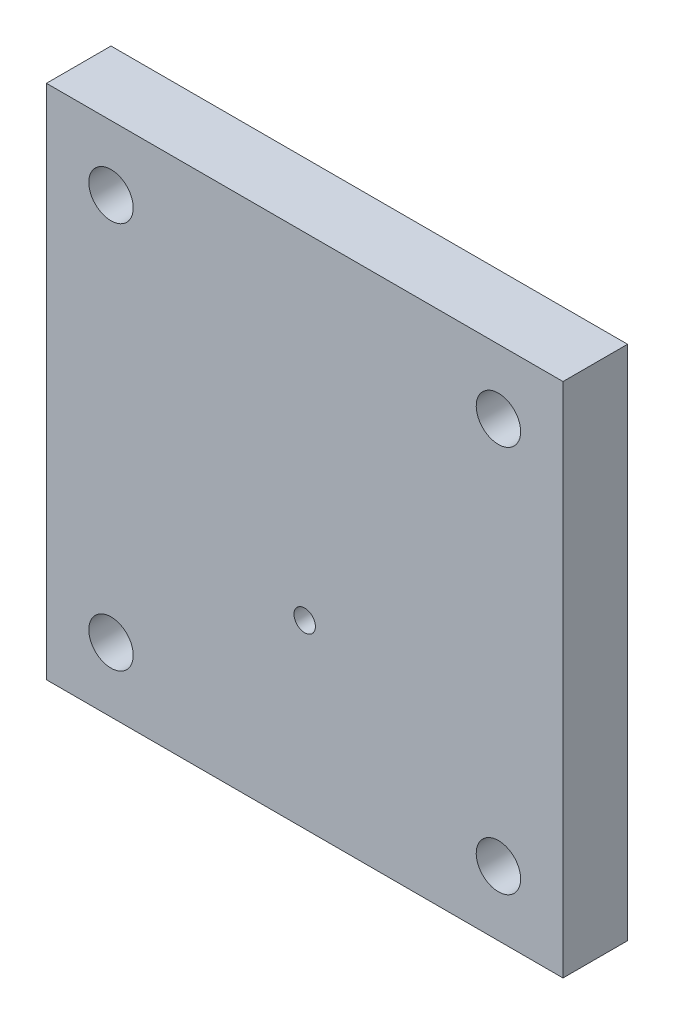
ISO-10303-21;
HEADER;
FILE_DESCRIPTION(('STEP AP214'),'2;1');
FILE_NAME('part.step','',(''),(''),'','','');
FILE_SCHEMA(('AUTOMOTIVE_DESIGN { 1 0 10303 214 1 1 1 1 }'));
ENDSEC;
DATA;
#1=APPLICATION_CONTEXT('core data for automotive mechanical design processes');
#2=APPLICATION_PROTOCOL_DEFINITION('international standard','automotive_design',2000,#1);
#3=PRODUCT_CONTEXT('',#1,'mechanical');
#4=PRODUCT('Part','Part','',(#3));
#5=PRODUCT_RELATED_PRODUCT_CATEGORY('part','',(#4));
#6=PRODUCT_DEFINITION_FORMATION('','',#4);
#7=PRODUCT_DEFINITION_CONTEXT('part definition',#1,'design');
#8=PRODUCT_DEFINITION('design','',#6,#7);
#9=PRODUCT_DEFINITION_SHAPE('','',#8);
#10=(LENGTH_UNIT() NAMED_UNIT(*) SI_UNIT(.MILLI.,.METRE.));
#11=(NAMED_UNIT(*) PLANE_ANGLE_UNIT() SI_UNIT($,.RADIAN.));
#12=(NAMED_UNIT(*) SI_UNIT($,.STERADIAN.) SOLID_ANGLE_UNIT());
#13=UNCERTAINTY_MEASURE_WITH_UNIT(LENGTH_MEASURE(1.E-05),#10,'distance_accuracy_value','');
#14=(GEOMETRIC_REPRESENTATION_CONTEXT(3) GLOBAL_UNCERTAINTY_ASSIGNED_CONTEXT((#13)) GLOBAL_UNIT_ASSIGNED_CONTEXT((#10,
#11,#12)) REPRESENTATION_CONTEXT('',''));
#15=CARTESIAN_POINT('',(0.,0.,0.));
#16=DIRECTION('',(0.,0.,1.));
#17=DIRECTION('',(1.,0.,0.));
#18=AXIS2_PLACEMENT_3D('',#15,#16,#17);
#19=CARTESIAN_POINT('',(-50.8,50.8,49.2));
#20=DIRECTION('',(1.,0.,0.));
#21=DIRECTION('',(0.,1.,0.));
#22=AXIS2_PLACEMENT_3D('',#19,#20,#21);
#23=PLANE('',#22);
#24=DIRECTION('',(0.,1.,0.));
#25=VECTOR('',#24,1.);
#26=CARTESIAN_POINT('',(-50.8,50.8,36.5000691489381));
#27=LINE('',#26,#25);
#28=CARTESIAN_POINT('',(-50.8,-50.8,36.5000691489379));
#29=VERTEX_POINT('',#28);
#30=CARTESIAN_POINT('',(-50.8,50.8,36.500069148938));
#31=VERTEX_POINT('',#30);
#32=EDGE_CURVE('E170',#29,#31,#27,.T.);
#33=ORIENTED_EDGE('',*,*,#32,.F.);
#34=DIRECTION('',(0.,0.,-1.));
#35=VECTOR('',#34,1.);
#36=CARTESIAN_POINT('',(-50.8,-50.8,49.2));
#37=LINE('',#36,#35);
#38=CARTESIAN_POINT('',(-50.8,-50.8,49.2));
#39=VERTEX_POINT('',#38);
#40=EDGE_CURVE('E184',#39,#29,#37,.T.);
#41=ORIENTED_EDGE('',*,*,#40,.F.);
#42=DIRECTION('',(0.,-1.,0.));
#43=VECTOR('',#42,1.);
#44=CARTESIAN_POINT('',(-50.8,50.8,49.2));
#45=LINE('',#44,#43);
#46=CARTESIAN_POINT('',(-50.8,50.8,49.2));
#47=VERTEX_POINT('',#46);
#48=EDGE_CURVE('E268',#47,#39,#45,.T.);
#49=ORIENTED_EDGE('',*,*,#48,.F.);
#50=DIRECTION('',(0.,0.,-1.));
#51=VECTOR('',#50,1.);
#52=CARTESIAN_POINT('',(-50.8,50.8,49.2));
#53=LINE('',#52,#51);
#54=EDGE_CURVE('E186',#47,#31,#53,.T.);
#55=ORIENTED_EDGE('',*,*,#54,.T.);
#56=EDGE_LOOP('',(#33,#41,#49,#55));
#57=FACE_BOUND('',#56,.T.);
#58=ADVANCED_FACE('F54',(#57),#23,.F.);
#59=CARTESIAN_POINT('',(-50.8,-50.8,49.2));
#60=DIRECTION('',(0.,1.,0.));
#61=DIRECTION('',(-1.,0.,0.));
#62=AXIS2_PLACEMENT_3D('',#59,#60,#61);
#63=PLANE('',#62);
#64=DIRECTION('',(-1.,0.,0.));
#65=VECTOR('',#64,1.);
#66=CARTESIAN_POINT('',(-50.8,-50.8,36.5000691489379));
#67=LINE('',#66,#65);
#68=CARTESIAN_POINT('',(50.8,-50.7999999999999,36.5000691489377));
#69=VERTEX_POINT('',#68);
#70=EDGE_CURVE('E167',#69,#29,#67,.T.);
#71=ORIENTED_EDGE('',*,*,#70,.F.);
#72=DIRECTION('',(0.,0.,-1.));
#73=VECTOR('',#72,1.);
#74=CARTESIAN_POINT('',(50.8,-50.7999999999999,49.2));
#75=LINE('',#74,#73);
#76=CARTESIAN_POINT('',(50.8,-50.7999999999999,49.2));
#77=VERTEX_POINT('',#76);
#78=EDGE_CURVE('E197',#77,#69,#75,.T.);
#79=ORIENTED_EDGE('',*,*,#78,.F.);
#80=DIRECTION('',(1.,0.,0.));
#81=VECTOR('',#80,1.);
#82=CARTESIAN_POINT('',(-50.8,-50.8,49.2));
#83=LINE('',#82,#81);
#84=EDGE_CURVE('E194',#39,#77,#83,.T.);
#85=ORIENTED_EDGE('',*,*,#84,.F.);
#86=ORIENTED_EDGE('',*,*,#40,.T.);
#87=EDGE_LOOP('',(#71,#79,#85,#86));
#88=FACE_BOUND('',#87,.T.);
#89=ADVANCED_FACE('F192',(#88),#63,.F.);
#90=CARTESIAN_POINT('',(50.8,50.8,49.2));
#91=DIRECTION('',(-1.,0.,0.));
#92=DIRECTION('',(0.,-1.,0.));
#93=AXIS2_PLACEMENT_3D('',#90,#91,#92);
#94=PLANE('',#93);
#95=DIRECTION('',(0.,-1.,0.));
#96=VECTOR('',#95,1.);
#97=CARTESIAN_POINT('',(50.8,50.8,36.500069148938));
#98=LINE('',#97,#96);
#99=CARTESIAN_POINT('',(50.8,50.8,36.500069148938));
#100=VERTEX_POINT('',#99);
#101=EDGE_CURVE('E173',#100,#69,#98,.T.);
#102=ORIENTED_EDGE('',*,*,#101,.F.);
#103=DIRECTION('',(0.,0.,-1.));
#104=VECTOR('',#103,1.);
#105=CARTESIAN_POINT('',(50.8,50.8,49.2));
#106=LINE('',#105,#104);
#107=CARTESIAN_POINT('',(50.8,50.8,49.2));
#108=VERTEX_POINT('',#107);
#109=EDGE_CURVE('E203',#108,#100,#106,.T.);
#110=ORIENTED_EDGE('',*,*,#109,.F.);
#111=DIRECTION('',(0.,1.,0.));
#112=VECTOR('',#111,1.);
#113=CARTESIAN_POINT('',(50.8,50.8,49.2));
#114=LINE('',#113,#112);
#115=EDGE_CURVE('E274',#77,#108,#114,.T.);
#116=ORIENTED_EDGE('',*,*,#115,.F.);
#117=ORIENTED_EDGE('',*,*,#78,.T.);
#118=EDGE_LOOP('',(#102,#110,#116,#117));
#119=FACE_BOUND('',#118,.T.);
#120=ADVANCED_FACE('F293',(#119),#94,.F.);
#121=CARTESIAN_POINT('',(-50.8,50.8,49.2));
#122=DIRECTION('',(0.,-1.,0.));
#123=DIRECTION('',(0.,0.,-1.));
#124=AXIS2_PLACEMENT_3D('',#121,#122,#123);
#125=PLANE('',#124);
#126=DIRECTION('',(1.,0.,0.));
#127=VECTOR('',#126,1.);
#128=CARTESIAN_POINT('',(-50.8,50.8,36.5000691489381));
#129=LINE('',#128,#127);
#130=EDGE_CURVE('E189',#31,#100,#129,.T.);
#131=ORIENTED_EDGE('',*,*,#130,.F.);
#132=ORIENTED_EDGE('',*,*,#54,.F.);
#133=DIRECTION('',(-1.,0.,0.));
#134=VECTOR('',#133,1.);
#135=CARTESIAN_POINT('',(-50.8,50.8,49.2));
#136=LINE('',#135,#134);
#137=EDGE_CURVE('E278',#108,#47,#136,.T.);
#138=ORIENTED_EDGE('',*,*,#137,.F.);
#139=ORIENTED_EDGE('',*,*,#109,.T.);
#140=EDGE_LOOP('',(#131,#132,#138,#139));
#141=FACE_BOUND('',#140,.T.);
#142=ADVANCED_FACE('F289',(#141),#125,.F.);
#143=CARTESIAN_POINT('',(0.,0.,49.2));
#144=DIRECTION('',(0.,0.,1.));
#145=DIRECTION('',(1.,0.,0.));
#146=AXIS2_PLACEMENT_3D('',#143,#144,#145);
#147=PLANE('',#146);
#148=CARTESIAN_POINT('',(0.,-15.2908,49.2000000000005));
#149=DIRECTION('',(0.,0.,-1.));
#150=DIRECTION('',(0.,1.,0.));
#151=AXIS2_PLACEMENT_3D('',#148,#149,#150);
#152=CIRCLE('',#151,2.1082);
#153=CARTESIAN_POINT('',(0.,-13.1826,49.2000000000005));
#154=VERTEX_POINT('',#153);
#155=EDGE_CURVE('E1295',#154,#154,#152,.T.);
#156=ORIENTED_EDGE('',*,*,#155,.T.);
#157=EDGE_LOOP('',(#156));
#158=FACE_BOUND('',#157,.T.);
#159=CARTESIAN_POINT('',(38.1,38.1,49.2000000000002));
#160=DIRECTION('',(0.,0.,-1.));
#161=DIRECTION('',(0.,1.,0.));
#162=AXIS2_PLACEMENT_3D('',#159,#160,#161);
#163=CIRCLE('',#162,4.36879999999999);
#164=CARTESIAN_POINT('',(38.1,42.4688,49.2000000000002));
#165=VERTEX_POINT('',#164);
#166=EDGE_CURVE('E1304',#165,#165,#163,.T.);
#167=ORIENTED_EDGE('',*,*,#166,.T.);
#168=EDGE_LOOP('',(#167));
#169=FACE_BOUND('',#168,.T.);
#170=CARTESIAN_POINT('',(-38.1,38.1,49.2000000000003));
#171=DIRECTION('',(0.,0.,-1.));
#172=DIRECTION('',(0.,1.,0.));
#173=AXIS2_PLACEMENT_3D('',#170,#171,#172);
#174=CIRCLE('',#173,4.36879999999999);
#175=CARTESIAN_POINT('',(-38.1,42.4688,49.2000000000003));
#176=VERTEX_POINT('',#175);
#177=EDGE_CURVE('E1316',#176,#176,#174,.T.);
#178=ORIENTED_EDGE('',*,*,#177,.T.);
#179=EDGE_LOOP('',(#178));
#180=FACE_BOUND('',#179,.T.);
#181=CARTESIAN_POINT('',(-38.1,-38.1,49.2000000000002));
#182=DIRECTION('',(0.,0.,-1.));
#183=DIRECTION('',(0.,1.,0.));
#184=AXIS2_PLACEMENT_3D('',#181,#182,#183);
#185=CIRCLE('',#184,4.3688);
#186=CARTESIAN_POINT('',(-38.1,-33.7312,49.2000000000002));
#187=VERTEX_POINT('',#186);
#188=EDGE_CURVE('E1324',#187,#187,#185,.T.);
#189=ORIENTED_EDGE('',*,*,#188,.T.);
#190=EDGE_LOOP('',(#189));
#191=FACE_BOUND('',#190,.T.);
#192=CARTESIAN_POINT('',(38.1,-38.1,49.2000000000001));
#193=DIRECTION('',(0.,0.,-1.));
#194=DIRECTION('',(0.,1.,0.));
#195=AXIS2_PLACEMENT_3D('',#192,#193,#194);
#196=CIRCLE('',#195,4.36879999999999);
#197=CARTESIAN_POINT('',(38.1,-33.7312,49.2000000000001));
#198=VERTEX_POINT('',#197);
#199=EDGE_CURVE('E271',#198,#198,#196,.T.);
#200=ORIENTED_EDGE('',*,*,#199,.T.);
#201=EDGE_LOOP('',(#200));
#202=FACE_BOUND('',#201,.T.);
#203=ORIENTED_EDGE('',*,*,#48,.T.);
#204=ORIENTED_EDGE('',*,*,#84,.T.);
#205=ORIENTED_EDGE('',*,*,#115,.T.);
#206=ORIENTED_EDGE('',*,*,#137,.T.);
#207=EDGE_LOOP('',(#203,#204,#205,#206));
#208=FACE_BOUND('',#207,.T.);
#209=ADVANCED_FACE('F767',(#158,#169,#180,#191,#202,#208),#147,.T.);
#210=CARTESIAN_POINT('',(32.0362429938083,27.4582223463594,36.5000691489379));
#211=DIRECTION('',(0.,0.,-1.));
#212=DIRECTION('',(-0.954386697971061,0.298573325559894,0.));
#213=AXIS2_PLACEMENT_3D('',#210,#211,#212);
#214=PLANE('',#213);
#215=CARTESIAN_POINT('',(38.1,38.1,36.500069148938));
#216=DIRECTION('',(0.,0.,-1.));
#217=DIRECTION('',(0.,1.,0.));
#218=AXIS2_PLACEMENT_3D('',#215,#216,#217);
#219=CIRCLE('',#218,4.36879999999999);
#220=CARTESIAN_POINT('',(38.1,42.4688,36.500069148938));
#221=VERTEX_POINT('',#220);
#222=EDGE_CURVE('E1299',#221,#221,#219,.T.);
#223=ORIENTED_EDGE('',*,*,#222,.F.);
#224=EDGE_LOOP('',(#223));
#225=FACE_BOUND('',#224,.T.);
#226=CARTESIAN_POINT('',(-38.1,38.1,36.5000691489381));
#227=DIRECTION('',(0.,0.,-1.));
#228=DIRECTION('',(0.,1.,0.));
#229=AXIS2_PLACEMENT_3D('',#226,#227,#228);
#230=CIRCLE('',#229,4.36879999999999);
#231=CARTESIAN_POINT('',(-38.1,42.4688,36.5000691489381));
#232=VERTEX_POINT('',#231);
#233=EDGE_CURVE('E1312',#232,#232,#230,.T.);
#234=ORIENTED_EDGE('',*,*,#233,.F.);
#235=EDGE_LOOP('',(#234));
#236=FACE_BOUND('',#235,.T.);
#237=CARTESIAN_POINT('',(-38.1,-38.0999999999999,36.5000691489379));
#238=DIRECTION('',(0.,0.,-1.));
#239=DIRECTION('',(0.,1.,0.));
#240=AXIS2_PLACEMENT_3D('',#237,#238,#239);
#241=CIRCLE('',#240,4.36879999999999);
#242=CARTESIAN_POINT('',(-38.1,-33.7312,36.5000691489379));
#243=VERTEX_POINT('',#242);
#244=EDGE_CURVE('E1320',#243,#243,#241,.T.);
#245=ORIENTED_EDGE('',*,*,#244,.F.);
#246=EDGE_LOOP('',(#245));
#247=FACE_BOUND('',#246,.T.);
#248=CARTESIAN_POINT('',(38.1,-38.0999999999999,36.5000691489378));
#249=DIRECTION('',(0.,0.,-1.));
#250=DIRECTION('',(0.,1.,0.));
#251=AXIS2_PLACEMENT_3D('',#248,#249,#250);
#252=CIRCLE('',#251,4.36879999999999);
#253=CARTESIAN_POINT('',(38.1,-33.7312,36.5000691489378));
#254=VERTEX_POINT('',#253);
#255=EDGE_CURVE('E1327',#254,#254,#252,.T.);
#256=ORIENTED_EDGE('',*,*,#255,.F.);
#257=EDGE_LOOP('',(#256));
#258=FACE_BOUND('',#257,.T.);
#259=DIRECTION('',(-0.954386697971061,0.298573325559894,0.));
#260=VECTOR('',#259,1.);
#261=CARTESIAN_POINT('',(10.6802454587244,34.1392995431125,36.500069148938));
#262=LINE('',#261,#260);
#263=CARTESIAN_POINT('',(32.0362429938083,27.4582223463595,36.500069148938));
#264=VERTEX_POINT('',#263);
#265=CARTESIAN_POINT('',(22.2232866846047,30.5281383511,36.5000691489379));
#266=VERTEX_POINT('',#265);
#267=EDGE_CURVE('E207',#264,#266,#262,.T.);
#268=ORIENTED_EDGE('',*,*,#267,.T.);
#269=DIRECTION('',(-0.866025403784439,-0.5,0.));
#270=VECTOR('',#269,1.);
#271=CARTESIAN_POINT('',(-7.66324999999815,13.2731383510989,36.500069148938));
#272=LINE('',#271,#270);
#273=CARTESIAN_POINT('',(7.53431132943539E-12,17.6975178014696,36.500069148938));
#274=VERTEX_POINT('',#273);
#275=EDGE_CURVE('E234',#266,#274,#272,.T.);
#276=ORIENTED_EDGE('',*,*,#275,.T.);
#277=DIRECTION('',(-0.866025403784438,0.5,0.));
#278=VECTOR('',#277,1.);
#279=CARTESIAN_POINT('',(7.66325000000185,13.2731383511055,36.500069148938));
#280=LINE('',#279,#278);
#281=CARTESIAN_POINT('',(-22.2232866845972,30.5281383511044,36.500069148938));
#282=VERTEX_POINT('',#281);
#283=EDGE_CURVE('E238',#274,#282,#280,.T.);
#284=ORIENTED_EDGE('',*,*,#283,.T.);
#285=DIRECTION('',(-0.949961036183229,-0.31236841987257,0.));
#286=VECTOR('',#285,1.);
#287=CARTESIAN_POINT('',(-11.2272690972266,34.143874689574,36.500069148938));
#288=LINE('',#287,#286);
#289=CARTESIAN_POINT('',(-31.9907385605814,27.3163818763956,36.500069148938));
#290=VERTEX_POINT('',#289);
#291=EDGE_CURVE('E246',#282,#290,#288,.T.);
#292=ORIENTED_EDGE('',*,*,#291,.T.);
#293=CARTESIAN_POINT('',(-25.6007002960395,14.6241988105204,36.500069148938));
#294=DIRECTION('',(0.,0.,-1.));
#295=DIRECTION('',(-1.,0.,0.));
#296=AXIS2_PLACEMENT_3D('',#293,#294,#295);
#297=CIRCLE('',#296,14.21);
#298=CARTESIAN_POINT('',(-39.7976395916092,14.0150891012674,36.500069148938));
#299=VERTEX_POINT('',#298);
#300=EDGE_CURVE('E257',#290,#299,#297,.F.);
#301=ORIENTED_EDGE('',*,*,#300,.T.);
#302=DIRECTION('',(0.21862126415826,-0.975809788256833,0.));
#303=VECTOR('',#302,1.);
#304=CARTESIAN_POINT('',(-34.9056234011011,-7.82028588564673,36.500069148938));
#305=LINE('',#304,#303);
#306=CARTESIAN_POINT('',(-37.5497866845972,3.98186164890001,36.500069148938));
#307=VERTEX_POINT('',#306);
#308=EDGE_CURVE('E261',#299,#307,#305,.T.);
#309=ORIENTED_EDGE('',*,*,#308,.T.);
#310=DIRECTION('',(0.866025403784438,-0.5,0.));
#311=VECTOR('',#310,1.);
#312=CARTESIAN_POINT('',(-7.66324999999816,-13.2731383510989,36.500069148938));
#313=LINE('',#312,#311);
#314=CARTESIAN_POINT('',(-15.3265,-8.84875890073042,36.500069148938));
#315=VERTEX_POINT('',#314);
#316=EDGE_CURVE('E347',#307,#315,#313,.T.);
#317=ORIENTED_EDGE('',*,*,#316,.T.);
#318=DIRECTION('',(0.,-1.,0.));
#319=VECTOR('',#318,1.);
#320=CARTESIAN_POINT('',(-15.3265,0.,36.500069148938));
#321=LINE('',#320,#319);
#322=CARTESIAN_POINT('',(-15.3265,-34.51,36.500069148938));
#323=VERTEX_POINT('',#322);
#324=EDGE_CURVE('E339',#315,#323,#321,.T.);
#325=ORIENTED_EDGE('',*,*,#324,.T.);
#326=DIRECTION('',(0.745499505041264,-0.666506180003779,0.));
#327=VECTOR('',#326,1.);
#328=CARTESIAN_POINT('',(-23.9558283161898,-26.7950375981085,36.500069148938));
#329=LINE('',#328,#327);
#330=CARTESIAN_POINT('',(-7.661311364141,-41.3629832174899,36.500069148938));
#331=VERTEX_POINT('',#330);
#332=EDGE_CURVE('E265',#323,#331,#329,.T.);
#333=ORIENTED_EDGE('',*,*,#332,.T.);
#334=CARTESIAN_POINT('',(0.135422468118648,-29.4829562163043,36.500069148938));
#335=DIRECTION('',(0.,0.,-1.));
#336=DIRECTION('',(-1.,0.,0.));
#337=AXIS2_PLACEMENT_3D('',#334,#335,#336);
#338=CIRCLE('',#337,14.21);
#339=CARTESIAN_POINT('',(7.76139659780842,-41.4733114476268,36.500069148938));
#340=VERTEX_POINT('',#339);
#341=EDGE_CURVE('E262',#331,#340,#338,.F.);
#342=ORIENTED_EDGE('',*,*,#341,.T.);
#343=DIRECTION('',(0.735765433812801,0.677236462696938,0.));
#344=VECTOR('',#343,1.);
#345=CARTESIAN_POINT('',(24.2253779423803,-26.3190136574657,36.500069148938));
#346=LINE('',#345,#344);
#347=CARTESIAN_POINT('',(15.3265,-34.51,36.500069148938));
#348=VERTEX_POINT('',#347);
#349=EDGE_CURVE('E266',#340,#348,#346,.T.);
#350=ORIENTED_EDGE('',*,*,#349,.T.);
#351=DIRECTION('',(0.,1.,0.));
#352=VECTOR('',#351,1.);
#353=CARTESIAN_POINT('',(15.3265,0.,36.500069148938));
#354=LINE('',#353,#352);
#355=CARTESIAN_POINT('',(15.3265,-8.84875890073918,36.500069148938));
#356=VERTEX_POINT('',#355);
#357=EDGE_CURVE('E327',#348,#356,#354,.T.);
#358=ORIENTED_EDGE('',*,*,#357,.T.);
#359=DIRECTION('',(0.866025403784439,0.5,0.));
#360=VECTOR('',#359,1.);
#361=CARTESIAN_POINT('',(7.66325000000184,-13.2731383511055,36.500069148938));
#362=LINE('',#361,#360);
#363=CARTESIAN_POINT('',(37.5497866846047,3.98186164889559,36.500069148938));
#364=VERTEX_POINT('',#363);
#365=EDGE_CURVE('E136',#356,#364,#362,.T.);
#366=ORIENTED_EDGE('',*,*,#365,.T.);
#367=DIRECTION('',(0.204461531141964,0.97887459987635,0.));
#368=VECTOR('',#367,1.);
#369=CARTESIAN_POINT('',(35.1830974134201,-7.34883709146547,36.500069148938));
#370=LINE('',#369,#368);
#371=CARTESIAN_POINT('',(39.6520499247298,14.0466013410942,36.500069148938));
#372=VERTEX_POINT('',#371);
#373=EDGE_CURVE('E143',#364,#372,#370,.T.);
#374=ORIENTED_EDGE('',*,*,#373,.T.);
#375=CARTESIAN_POINT('',(25.4652778279283,14.8587574057839,36.500069148938));
#376=DIRECTION('',(0.,0.,-1.));
#377=DIRECTION('',(-1.,0.,0.));
#378=AXIS2_PLACEMENT_3D('',#375,#376,#377);
#379=CIRCLE('',#378,14.21);
#380=EDGE_CURVE('E150',#372,#264,#379,.F.);
#381=ORIENTED_EDGE('',*,*,#380,.T.);
#382=EDGE_LOOP('',(#268,#276,#284,#292,#301,#309,#317,#325,#333,#342,#350,#358,#366,#374,#381));
#383=FACE_BOUND('',#382,.T.);
#384=ORIENTED_EDGE('',*,*,#32,.T.);
#385=ORIENTED_EDGE('',*,*,#130,.T.);
#386=ORIENTED_EDGE('',*,*,#101,.T.);
#387=ORIENTED_EDGE('',*,*,#70,.T.);
#388=EDGE_LOOP('',(#384,#385,#386,#387));
#389=FACE_BOUND('',#388,.T.);
#390=ADVANCED_FACE('F169',(#225,#236,#247,#258,#383,#389),#214,.T.);
#391=CARTESIAN_POINT('',(-25.4914577603912,14.7175000000022,36.500069148938));
#392=DIRECTION('',(0.,0.,1.));
#393=DIRECTION('',(1.,0.,0.));
#394=AXIS2_PLACEMENT_3D('',#391,#392,#393);
#395=CONICAL_SURFACE('',#394,9.667875,0.0174532925199433);
#396=CARTESIAN_POINT('',(-25.4914577603912,14.7175000000022,36.500069148938));
#397=DIRECTION('',(0.,0.,1.));
#398=DIRECTION('',(1.,0.,0.));
#399=AXIS2_PLACEMENT_3D('',#396,#397,#398);
#400=CIRCLE('',#399,9.667875);
#401=CARTESIAN_POINT('',(-15.8235827603912,14.7175000000022,36.500069148938));
#402=VERTEX_POINT('',#401);
#403=EDGE_CURVE('E237',#402,#402,#400,.T.);
#404=ORIENTED_EDGE('',*,*,#403,.T.);
#405=EDGE_LOOP('',(#404));
#406=FACE_BOUND('',#405,.T.);
#407=CARTESIAN_POINT('',(-25.4914577603912,14.7175000000022,40.052569148938));
#408=DIRECTION('',(0.,0.,1.));
#409=DIRECTION('',(1.,0.,0.));
#410=AXIS2_PLACEMENT_3D('',#407,#408,#409);
#411=CIRCLE('',#410,9.72988411815749);
#412=CARTESIAN_POINT('',(-15.7615736422337,14.7175000000022,40.052569148938));
#413=VERTEX_POINT('',#412);
#414=EDGE_CURVE('E484',#413,#413,#411,.F.);
#415=ORIENTED_EDGE('',*,*,#414,.T.);
#416=EDGE_LOOP('',(#415));
#417=FACE_BOUND('',#416,.T.);
#418=ADVANCED_FACE('F766',(#406,#417),#395,.T.);
#419=CARTESIAN_POINT('',(0.,-29.435,36.500069148938));
#420=DIRECTION('',(0.,0.,1.));
#421=DIRECTION('',(1.,0.,0.));
#422=AXIS2_PLACEMENT_3D('',#419,#420,#421);
#423=CONICAL_SURFACE('',#422,9.667875,0.0174532925199433);
#424=CARTESIAN_POINT('',(0.,-29.435,36.500069148938));
#425=DIRECTION('',(0.,0.,1.));
#426=DIRECTION('',(1.,0.,0.));
#427=AXIS2_PLACEMENT_3D('',#424,#425,#426);
#428=CIRCLE('',#427,9.667875);
#429=CARTESIAN_POINT('',(9.66787499999995,-29.435,36.500069148938));
#430=VERTEX_POINT('',#429);
#431=EDGE_CURVE('E483',#430,#430,#428,.T.);
#432=ORIENTED_EDGE('',*,*,#431,.T.);
#433=EDGE_LOOP('',(#432));
#434=FACE_BOUND('',#433,.T.);
#435=CARTESIAN_POINT('',(0.,-29.435,40.052569148938));
#436=DIRECTION('',(0.,0.,1.));
#437=DIRECTION('',(1.,0.,0.));
#438=AXIS2_PLACEMENT_3D('',#435,#436,#437);
#439=CIRCLE('',#438,9.72988411815749);
#440=CARTESIAN_POINT('',(9.72988411815745,-29.435,40.052569148938));
#441=VERTEX_POINT('',#440);
#442=EDGE_CURVE('E479',#441,#441,#439,.F.);
#443=ORIENTED_EDGE('',*,*,#442,.T.);
#444=EDGE_LOOP('',(#443));
#445=FACE_BOUND('',#444,.T.);
#446=ADVANCED_FACE('F806',(#434,#445),#423,.T.);
#447=CARTESIAN_POINT('',(0.,0.,36.500069148938));
#448=DIRECTION('',(0.,0.,1.));
#449=DIRECTION('',(1.,0.,0.));
#450=AXIS2_PLACEMENT_3D('',#447,#448,#449);
#451=CONICAL_SURFACE('',#450,11.165,0.0174532925199433);
#452=CARTESIAN_POINT('',(0.,0.,36.500069148938));
#453=DIRECTION('',(0.,0.,1.));
#454=DIRECTION('',(1.,0.,0.));
#455=AXIS2_PLACEMENT_3D('',#452,#453,#454);
#456=CIRCLE('',#455,11.165);
#457=CARTESIAN_POINT('',(11.165,0.,36.500069148938));
#458=VERTEX_POINT('',#457);
#459=EDGE_CURVE('E478',#458,#458,#456,.T.);
#460=ORIENTED_EDGE('',*,*,#459,.T.);
#461=EDGE_LOOP('',(#460));
#462=FACE_BOUND('',#461,.T.);
#463=CARTESIAN_POINT('',(0.,0.,40.052569148938));
#464=DIRECTION('',(0.,0.,1.));
#465=DIRECTION('',(1.,0.,0.));
#466=AXIS2_PLACEMENT_3D('',#463,#464,#465);
#467=CIRCLE('',#466,11.2270091181575);
#468=CARTESIAN_POINT('',(11.2270091181574,0.,40.052569148938));
#469=VERTEX_POINT('',#468);
#470=EDGE_CURVE('E474',#469,#469,#467,.F.);
#471=ORIENTED_EDGE('',*,*,#470,.T.);
#472=EDGE_LOOP('',(#471));
#473=FACE_BOUND('',#472,.T.);
#474=ADVANCED_FACE('F817',(#462,#473),#451,.T.);
#475=CARTESIAN_POINT('',(25.4914577603987,14.7174999999978,36.500069148938));
#476=DIRECTION('',(0.,0.,1.));
#477=DIRECTION('',(1.,0.,0.));
#478=AXIS2_PLACEMENT_3D('',#475,#476,#477);
#479=CONICAL_SURFACE('',#478,9.667875,0.0174532925199433);
#480=CARTESIAN_POINT('',(25.4914577603987,14.7174999999978,36.500069148938));
#481=DIRECTION('',(0.,0.,1.));
#482=DIRECTION('',(1.,0.,0.));
#483=AXIS2_PLACEMENT_3D('',#480,#481,#482);
#484=CIRCLE('',#483,9.667875);
#485=CARTESIAN_POINT('',(35.1593327603987,14.7174999999978,36.500069148938));
#486=VERTEX_POINT('',#485);
#487=EDGE_CURVE('E473',#486,#486,#484,.T.);
#488=ORIENTED_EDGE('',*,*,#487,.T.);
#489=EDGE_LOOP('',(#488));
#490=FACE_BOUND('',#489,.T.);
#491=CARTESIAN_POINT('',(25.4914577603987,14.7174999999978,40.052569148938));
#492=DIRECTION('',(0.,0.,1.));
#493=DIRECTION('',(1.,0.,0.));
#494=AXIS2_PLACEMENT_3D('',#491,#492,#493);
#495=CIRCLE('',#494,9.72988411815749);
#496=CARTESIAN_POINT('',(35.2213418785562,14.7174999999978,40.052569148938));
#497=VERTEX_POINT('',#496);
#498=EDGE_CURVE('E469',#497,#497,#495,.F.);
#499=ORIENTED_EDGE('',*,*,#498,.T.);
#500=EDGE_LOOP('',(#499));
#501=FACE_BOUND('',#500,.T.);
#502=ADVANCED_FACE('F828',(#490,#501),#479,.T.);
#503=CARTESIAN_POINT('',(-25.6007002960395,14.6241988105204,40.052569148938));
#504=DIRECTION('',(0.,0.,1.));
#505=DIRECTION('',(1.,0.,0.));
#506=AXIS2_PLACEMENT_3D('',#503,#504,#505);
#507=PLANE('',#506);
#508=CARTESIAN_POINT('',(0.,-15.2908,40.052569148938));
#509=DIRECTION('',(0.,0.,1.));
#510=DIRECTION('',(1.,0.,0.));
#511=AXIS2_PLACEMENT_3D('',#508,#509,#510);
#512=CIRCLE('',#511,2.1082);
#513=CARTESIAN_POINT('',(2.10820000000005,-15.2908,40.052569148938));
#514=VERTEX_POINT('',#513);
#515=EDGE_CURVE('E57',#514,#514,#512,.T.);
#516=ORIENTED_EDGE('',*,*,#515,.T.);
#517=EDGE_LOOP('',(#516));
#518=FACE_BOUND('',#517,.T.);
#519=ORIENTED_EDGE('',*,*,#498,.F.);
#520=EDGE_LOOP('',(#519));
#521=FACE_BOUND('',#520,.T.);
#522=ORIENTED_EDGE('',*,*,#470,.F.);
#523=EDGE_LOOP('',(#522));
#524=FACE_BOUND('',#523,.T.);
#525=DIRECTION('',(-0.866025403784438,0.5,0.));
#526=VECTOR('',#525,1.);
#527=CARTESIAN_POINT('',(-17.9007436210589,27.9609149876659,40.052569148938));
#528=LINE('',#527,#526);
#529=CARTESIAN_POINT('',(-22.2302682781621,30.4605672139076,40.052569148938));
#530=VERTEX_POINT('',#529);
#531=CARTESIAN_POINT('',(7.53422250730566E-12,17.6259158393487,40.052569148938));
#532=VERTEX_POINT('',#531);
#533=EDGE_CURVE('E468',#530,#532,#528,.F.);
#534=ORIENTED_EDGE('',*,*,#533,.T.);
#535=DIRECTION('',(-0.866025403784439,-0.5,0.));
#536=VECTOR('',#535,1.);
#537=CARTESIAN_POINT('',(-20.5003068229966,5.79005817661739,40.052569148938));
#538=LINE('',#537,#536);
#539=CARTESIAN_POINT('',(22.2307336312537,30.4608358856315,40.052569148938));
#540=VERTEX_POINT('',#539);
#541=EDGE_CURVE('E254',#532,#540,#538,.F.);
#542=ORIENTED_EDGE('',*,*,#541,.T.);
#543=DIRECTION('',(-0.954386697971061,0.298573325559894,0.));
#544=VECTOR('',#543,1.);
#545=CARTESIAN_POINT('',(-16.8239982384054,42.6788405979391,40.052569148938));
#546=LINE('',#545,#544);
#547=CARTESIAN_POINT('',(32.0124561065836,27.4006911713642,40.052569148938));
#548=VERTEX_POINT('',#547);
#549=EDGE_CURVE('E582',#540,#548,#546,.F.);
#550=ORIENTED_EDGE('',*,*,#549,.T.);
#551=CARTESIAN_POINT('',(25.4652778279283,14.8587574057839,40.052569148938));
#552=DIRECTION('',(0.,0.,1.));
#553=DIRECTION('',(1.,0.,0.));
#554=AXIS2_PLACEMENT_3D('',#551,#552,#553);
#555=CIRCLE('',#554,14.1479908818425);
#556=CARTESIAN_POINT('',(39.5904051675941,14.0547526601831,40.052569148938));
#557=VERTEX_POINT('',#556);
#558=EDGE_CURVE('E586',#548,#557,#555,.F.);
#559=ORIENTED_EDGE('',*,*,#558,.T.);
#560=DIRECTION('',(0.204461531141964,0.97887459987635,0.));
#561=VECTOR('',#560,1.);
#562=CARTESIAN_POINT('',(36.979092649272,1.55290215437901,40.052569148938));
#563=LINE('',#562,#561);
#564=CARTESIAN_POINT('',(37.4947591600121,4.02169345488011,40.052569148938));
#565=VERTEX_POINT('',#564);
#566=EDGE_CURVE('E590',#557,#565,#563,.F.);
#567=ORIENTED_EDGE('',*,*,#566,.T.);
#568=DIRECTION('',(0.866025403784439,0.5,0.));
#569=VECTOR('',#568,1.);
#570=CARTESIAN_POINT('',(-5.23581594115407,-20.6488155824057,40.052569148938));
#571=LINE('',#570,#569);
#572=CARTESIAN_POINT('',(15.2644908818425,-8.81295791967874,40.052569148938));
#573=VERTEX_POINT('',#572);
#574=EDGE_CURVE('E434',#565,#573,#571,.F.);
#575=ORIENTED_EDGE('',*,*,#574,.T.);
#576=DIRECTION('',(0.,1.,0.));
#577=VECTOR('',#576,1.);
#578=CARTESIAN_POINT('',(15.2644908818425,14.6241988105204,40.052569148938));
#579=LINE('',#578,#577);
#580=CARTESIAN_POINT('',(15.2644908818425,-34.4827980122444,40.052569148938));
#581=VERTEX_POINT('',#580);
#582=EDGE_CURVE('E426',#573,#581,#579,.F.);
#583=ORIENTED_EDGE('',*,*,#582,.T.);
#584=DIRECTION('',(0.735765433812801,0.677236462696938,0.));
#585=VECTOR('',#584,1.);
#586=CARTESIAN_POINT('',(17.6114749784328,-32.3225127711397,40.052569148938));
#587=LINE('',#586,#585);
#588=CARTESIAN_POINT('',(7.72346658236533,-41.4239458115156,40.052569148938));
#589=VERTEX_POINT('',#588);
#590=EDGE_CURVE('E431',#581,#589,#587,.F.);
#591=ORIENTED_EDGE('',*,*,#590,.T.);
#592=CARTESIAN_POINT('',(0.135422468118648,-29.4829562163043,40.052569148938));
#593=DIRECTION('',(0.,0.,1.));
#594=DIRECTION('',(1.,0.,0.));
#595=AXIS2_PLACEMENT_3D('',#592,#593,#594);
#596=CIRCLE('',#595,14.1479908818425);
#597=CARTESIAN_POINT('',(-7.62342973616779,-41.3136729513446,40.052569148938));
#598=VERTEX_POINT('',#597);
#599=EDGE_CURVE('E332',#589,#598,#596,.F.);
#600=ORIENTED_EDGE('',*,*,#599,.T.);
#601=DIRECTION('',(0.745499505041264,-0.666506180003779,0.));
#602=VECTOR('',#601,1.);
#603=CARTESIAN_POINT('',(-45.4090598707471,-7.53181819526375,40.052569148938));
#604=LINE('',#603,#602);
#605=CARTESIAN_POINT('',(-15.2644908818425,-34.4822606687877,40.052569148938));
#606=VERTEX_POINT('',#605);
#607=EDGE_CURVE('E441',#598,#606,#604,.F.);
#608=ORIENTED_EDGE('',*,*,#607,.T.);
#609=DIRECTION('',(0.,-1.,0.));
#610=VECTOR('',#609,1.);
#611=CARTESIAN_POINT('',(-15.2644908818426,14.6241988105204,40.052569148938));
#612=LINE('',#611,#610);
#613=CARTESIAN_POINT('',(-15.2644908818426,-8.81295791966998,40.052569148938));
#614=VERTEX_POINT('',#613);
#615=EDGE_CURVE('E448',#606,#614,#612,.F.);
#616=ORIENTED_EDGE('',*,*,#615,.T.);
#617=DIRECTION('',(0.866025403784438,-0.5,0.));
#618=VECTOR('',#617,1.);
#619=CARTESIAN_POINT('',(-33.1652345029014,1.52204122864282,40.052569148938));
#620=LINE('',#619,#618);
#621=CARTESIAN_POINT('',(-37.4952245130887,4.02196212661288,40.052569148938));
#622=VERTEX_POINT('',#621);
#623=EDGE_CURVE('E452',#614,#622,#620,.F.);
#624=ORIENTED_EDGE('',*,*,#623,.T.);
#625=DIRECTION('',(0.21862126415826,-0.975809788256833,0.));
#626=VECTOR('',#625,1.);
#627=CARTESIAN_POINT('',(-39.1885271840829,11.5799703889811,40.052569148938));
#628=LINE('',#627,#626);
#629=CARTESIAN_POINT('',(-39.7359226889415,14.0232546401515,40.052569148938));
#630=VERTEX_POINT('',#629);
#631=EDGE_CURVE('E456',#622,#630,#628,.F.);
#632=ORIENTED_EDGE('',*,*,#631,.T.);
#633=CARTESIAN_POINT('',(-25.6007002960395,14.6241988105204,40.052569148938));
#634=DIRECTION('',(0.,0.,1.));
#635=DIRECTION('',(1.,0.,0.));
#636=AXIS2_PLACEMENT_3D('',#633,#634,#635);
#637=CIRCLE('',#636,14.1479908818425);
#638=CARTESIAN_POINT('',(-31.9669754314187,27.2589202911615,40.052569148938));
#639=VERTEX_POINT('',#638);
#640=EDGE_CURVE('E460',#630,#639,#637,.F.);
#641=ORIENTED_EDGE('',*,*,#640,.T.);
#642=DIRECTION('',(-0.949961036183229,-0.31236841987257,0.));
#643=VECTOR('',#642,1.);
#644=CARTESIAN_POINT('',(-29.9710832225803,27.9152142566654,40.052569148938));
#645=LINE('',#644,#643);
#646=EDGE_CURVE('E464',#639,#530,#645,.F.);
#647=ORIENTED_EDGE('',*,*,#646,.T.);
#648=EDGE_LOOP('',(#534,#542,#550,#559,#567,#575,#583,#591,#600,#608,#616,#624,#632,#641,#647));
#649=FACE_BOUND('',#648,.T.);
#650=ORIENTED_EDGE('',*,*,#442,.F.);
#651=EDGE_LOOP('',(#650));
#652=FACE_BOUND('',#651,.T.);
#653=ORIENTED_EDGE('',*,*,#414,.F.);
#654=EDGE_LOOP('',(#653));
#655=FACE_BOUND('',#654,.T.);
#656=ADVANCED_FACE('F429',(#518,#521,#524,#649,#652,#655),#507,.F.);
#657=CARTESIAN_POINT('',(-11.2272690972266,34.143874689574,36.500069148938));
#658=DIRECTION('',(-0.312320844649233,0.949816352516179,0.0174524064372835));
#659=DIRECTION('',(-0.949961036183229,-0.31236841987257,0.));
#660=AXIS2_PLACEMENT_3D('',#657,#658,#659);
#661=PLANE('',#660);
#662=DIRECTION('',(-0.00196490288634688,-0.0190172517602627,0.999817224942706));
#663=VECTOR('',#662,1.);
#664=CARTESIAN_POINT('',(-22.2238160658581,30.5230147509587,36.7694384428783));
#665=LINE('',#664,#663);
#666=EDGE_CURVE('E249',#282,#530,#665,.T.);
#667=ORIENTED_EDGE('',*,*,#666,.T.);
#668=ORIENTED_EDGE('',*,*,#646,.F.);
#669=CARTESIAN_POINT('',(-31.9907385605814,27.3163818763956,36.500069148938));
#670=CARTESIAN_POINT('',(-31.9867788440779,27.3068046807932,37.0921524833742));
#671=CARTESIAN_POINT('',(-31.9828187250622,27.297227617556,37.684235817259));
#672=CARTESIAN_POINT('',(-31.9748976820062,27.2780737558119,38.8684024839257));
#673=CARTESIAN_POINT('',(-31.9709367579659,27.268496957305,39.4604858167076));
#674=CARTESIAN_POINT('',(-31.9669754314133,27.2589202911633,40.052569148938));
#675=B_SPLINE_CURVE_WITH_KNOTS('',3,(#669,#670,#671,#672,#673,#674),.UNSPECIFIED.,.F.,.F.,(4,2,
4),(0.,1.77652207769082,3.55304415538165),.UNSPECIFIED.);
#676=EDGE_CURVE('E253',#290,#639,#675,.T.);
#677=ORIENTED_EDGE('',*,*,#676,.F.);
#678=ORIENTED_EDGE('',*,*,#291,.F.);
#679=EDGE_LOOP('',(#667,#668,#677,#678));
#680=FACE_BOUND('',#679,.T.);
#681=ADVANCED_FACE('F511',(#680),#661,.F.);
#682=CARTESIAN_POINT('',(-25.6007002960395,14.6241988105204,36.500069148938));
#683=DIRECTION('',(0.,0.,-1.));
#684=DIRECTION('',(1.,0.,0.));
#685=AXIS2_PLACEMENT_3D('',#682,#683,#684);
#686=CONICAL_SURFACE('',#685,14.21,0.0174532925199433);
#687=ORIENTED_EDGE('',*,*,#676,.T.);
#688=ORIENTED_EDGE('',*,*,#640,.F.);
#689=CARTESIAN_POINT('',(-39.7976395916092,14.0150891012673,36.500069148938));
#690=CARTESIAN_POINT('',(-39.7873536629709,14.0164510145665,37.0921524838488));
#691=CARTESIAN_POINT('',(-39.7770676234294,14.0178124327898,37.6842358179709));
#692=CARTESIAN_POINT('',(-39.7564953225401,14.0205342790845,38.8684024846376));
#693=CARTESIAN_POINT('',(-39.7462090611923,14.0218947071559,39.4604858171822));
#694=CARTESIAN_POINT('',(-39.7359226889415,14.0232546401514,40.052569148938));
#695=B_SPLINE_CURVE_WITH_KNOTS('',3,(#689,#690,#691,#692,#693,#694),.UNSPECIFIED.,.F.,.F.,(4,2,
4),(0.,1.77652272023955,3.55304544047912),.UNSPECIFIED.);
#696=EDGE_CURVE('E509',#299,#630,#695,.T.);
#697=ORIENTED_EDGE('',*,*,#696,.F.);
#698=ORIENTED_EDGE('',*,*,#300,.F.);
#699=EDGE_LOOP('',(#687,#688,#697,#698));
#700=FACE_BOUND('',#699,.T.);
#701=ADVANCED_FACE('F514',(#700),#686,.F.);
#702=CARTESIAN_POINT('',(-34.9056234011011,-7.82028588564673,36.500069148938));
#703=DIRECTION('',(-0.97566116769964,-0.218587967080812,0.0174524064372835));
#704=DIRECTION('',(0.21862126415826,-0.975809788256833,0.));
#705=AXIS2_PLACEMENT_3D('',#702,#703,#704);
#706=PLANE('',#705);
#707=ORIENTED_EDGE('',*,*,#696,.T.);
#708=ORIENTED_EDGE('',*,*,#631,.F.);
#709=DIRECTION('',(0.0153560204610306,0.0112859099854528,0.999818393945321));
#710=VECTOR('',#709,1.);
#711=CARTESIAN_POINT('',(-37.5512085622473,3.98081663966666,36.4074918153699));
#712=LINE('',#711,#710);
#713=EDGE_CURVE('E530',#307,#622,#712,.T.);
#714=ORIENTED_EDGE('',*,*,#713,.F.);
#715=ORIENTED_EDGE('',*,*,#308,.F.);
#716=EDGE_LOOP('',(#707,#708,#714,#715));
#717=FACE_BOUND('',#716,.T.);
#718=ADVANCED_FACE('F518',(#717),#706,.F.);
#719=CARTESIAN_POINT('',(-7.66324999999816,-13.2731383510989,36.500069148938));
#720=DIRECTION('',(-0.499923847578196,-0.865893503920754,0.0174524064372835));
#721=DIRECTION('',(0.866025403784438,-0.5,0.));
#722=AXIS2_PLACEMENT_3D('',#719,#720,#721);
#723=PLANE('',#722);
#724=ORIENTED_EDGE('',*,*,#713,.T.);
#725=ORIENTED_EDGE('',*,*,#623,.F.);
#726=DIRECTION('',(0.0174515205435364,0.010075640083579,0.999796942337605));
#727=VECTOR('',#726,1.);
#728=CARTESIAN_POINT('',(-15.3249440763558,-8.8478605877956,36.5892079548144));
#729=LINE('',#728,#727);
#730=EDGE_CURVE('E539',#315,#614,#729,.T.);
#731=ORIENTED_EDGE('',*,*,#730,.F.);
#732=ORIENTED_EDGE('',*,*,#316,.F.);
#733=EDGE_LOOP('',(#724,#725,#731,#732));
#734=FACE_BOUND('',#733,.T.);
#735=ADVANCED_FACE('F560',(#734),#723,.F.);
#736=CARTESIAN_POINT('',(-15.3265,0.,36.500069148938));
#737=DIRECTION('',(-0.999847695156391,0.,0.0174524064372835));
#738=DIRECTION('',(0.0174524064372835,0.,0.999847695156391));
#739=AXIS2_PLACEMENT_3D('',#736,#737,#738);
#740=PLANE('',#739);
#741=ORIENTED_EDGE('',*,*,#730,.T.);
#742=ORIENTED_EDGE('',*,*,#615,.F.);
#743=DIRECTION('',(0.0174518745777253,0.00780697006458562,0.999817224942706));
#744=VECTOR('',#743,1.);
#745=CARTESIAN_POINT('',(-15.3217981414846,-34.5078966575474,36.7694384428783));
#746=LINE('',#745,#744);
#747=EDGE_CURVE('E362',#323,#606,#746,.T.);
#748=ORIENTED_EDGE('',*,*,#747,.F.);
#749=ORIENTED_EDGE('',*,*,#324,.F.);
#750=EDGE_LOOP('',(#741,#742,#748,#749));
#751=FACE_BOUND('',#750,.T.);
#752=ADVANCED_FACE('F557',(#751),#740,.F.);
#753=CARTESIAN_POINT('',(-23.9558283161898,-26.7950375981085,36.500069148938));
#754=DIRECTION('',(-0.666404667884269,-0.745385961855739,0.0174524064372835));
#755=DIRECTION('',(0.745499505041264,-0.666506180003779,0.));
#756=AXIS2_PLACEMENT_3D('',#753,#754,#755);
#757=PLANE('',#756);
#758=ORIENTED_EDGE('',*,*,#747,.T.);
#759=ORIENTED_EDGE('',*,*,#607,.F.);
#760=CARTESIAN_POINT('',(-7.66131136414102,-41.3629832174898,36.500069148938));
#761=CARTESIAN_POINT('',(-7.65499712770403,-41.3547654046049,37.0921524833742));
#762=CARTESIAN_POINT('',(-7.64868320715479,-41.3465473093167,37.684235817259));
#763=CARTESIAN_POINT('',(-7.63605599783181,-41.3301105539337,38.8684024839257));
#764=CARTESIAN_POINT('',(-7.62974270905807,-41.3218918938389,39.4604858167076));
#765=CARTESIAN_POINT('',(-7.62342973617208,-41.3136729513408,40.052569148938));
#766=B_SPLINE_CURVE_WITH_KNOTS('',3,(#760,#761,#762,#763,#764,#765),.UNSPECIFIED.,.F.,.F.,(4,2,
4),(0.,1.77652207769082,3.55304415538165),.UNSPECIFIED.);
#767=EDGE_CURVE('E334',#331,#598,#766,.T.);
#768=ORIENTED_EDGE('',*,*,#767,.F.);
#769=ORIENTED_EDGE('',*,*,#332,.F.);
#770=EDGE_LOOP('',(#758,#759,#768,#769));
#771=FACE_BOUND('',#770,.T.);
#772=ADVANCED_FACE('F368',(#771),#757,.F.);
#773=CARTESIAN_POINT('',(0.135422468118648,-29.4829562163043,36.500069148938));
#774=DIRECTION('',(0.,0.,-1.));
#775=DIRECTION('',(1.,0.,0.));
#776=AXIS2_PLACEMENT_3D('',#773,#774,#775);
#777=CONICAL_SURFACE('',#776,14.21,0.0174532925199433);
#778=ORIENTED_EDGE('',*,*,#767,.T.);
#779=ORIENTED_EDGE('',*,*,#599,.F.);
#780=CARTESIAN_POINT('',(7.76139659780843,-41.4733114476268,36.500069148938));
#781=CARTESIAN_POINT('',(7.75507418197441,-41.465084528774,37.0921524838488));
#782=CARTESIAN_POINT('',(7.74875213943715,-41.4568572663384,37.6842358179709));
#783=CARTESIAN_POINT('',(7.73610880095612,-41.4404020543013,38.8684024846376));
#784=CARTESIAN_POINT('',(7.72978750501235,-41.4321741046999,39.4604858171822));
#785=CARTESIAN_POINT('',(7.72346658236533,-41.4239458115156,40.052569148938));
#786=B_SPLINE_CURVE_WITH_KNOTS('',3,(#780,#781,#782,#783,#784,#785),.UNSPECIFIED.,.F.,.F.,(4,2,
4),(0.,1.77652272023955,3.55304544047912),.UNSPECIFIED.);
#787=EDGE_CURVE('E322',#340,#589,#786,.T.);
#788=ORIENTED_EDGE('',*,*,#787,.F.);
#789=ORIENTED_EDGE('',*,*,#341,.F.);
#790=EDGE_LOOP('',(#778,#779,#788,#789));
#791=FACE_BOUND('',#790,.T.);
#792=ADVANCED_FACE('F330',(#791),#777,.F.);
#793=CARTESIAN_POINT('',(24.2253779423803,-26.3190136574657,36.500069148938));
#794=DIRECTION('',(0.677133316303401,-0.735653373173471,0.0174524064372835));
#795=DIRECTION('',(0.735765433812801,0.677236462696938,0.));
#796=AXIS2_PLACEMENT_3D('',#793,#794,#795);
#797=PLANE('',#796);
#798=ORIENTED_EDGE('',*,*,#787,.T.);
#799=ORIENTED_EDGE('',*,*,#590,.F.);
#800=DIRECTION('',(-0.0174518949827418,0.00765574882755971,0.999818393945321));
#801=VECTOR('',#800,1.);
#802=CARTESIAN_POINT('',(15.3281159433683,-34.5107088775494,36.4074918153699));
#803=LINE('',#802,#801);
#804=EDGE_CURVE('E324',#348,#581,#803,.T.);
#805=ORIENTED_EDGE('',*,*,#804,.F.);
#806=ORIENTED_EDGE('',*,*,#349,.F.);
#807=EDGE_LOOP('',(#798,#799,#805,#806));
#808=FACE_BOUND('',#807,.T.);
#809=ADVANCED_FACE('F320',(#808),#797,.F.);
#810=CARTESIAN_POINT('',(15.3265,0.,36.500069148938));
#811=DIRECTION('',(0.999847695156391,0.,0.0174524064372835));
#812=DIRECTION('',(0.0174524064372835,0.,-0.999847695156391));
#813=AXIS2_PLACEMENT_3D('',#810,#811,#812);
#814=PLANE('',#813);
#815=ORIENTED_EDGE('',*,*,#804,.T.);
#816=ORIENTED_EDGE('',*,*,#582,.F.);
#817=DIRECTION('',(-0.0174515205435363,0.010075640083579,0.999796942337605));
#818=VECTOR('',#817,1.);
#819=CARTESIAN_POINT('',(15.3249440763558,-8.84786058780436,36.5892079548144));
#820=LINE('',#819,#818);
#821=EDGE_CURVE('E405',#356,#573,#820,.T.);
#822=ORIENTED_EDGE('',*,*,#821,.F.);
#823=ORIENTED_EDGE('',*,*,#357,.F.);
#824=EDGE_LOOP('',(#815,#816,#822,#823));
#825=FACE_BOUND('',#824,.T.);
#826=ADVANCED_FACE('F377',(#825),#814,.F.);
#827=CARTESIAN_POINT('',(7.66325000000184,-13.2731383511055,36.500069148938));
#828=DIRECTION('',(0.499923847578195,-0.865893503920754,0.0174524064372835));
#829=DIRECTION('',(0.866025403784439,0.5,0.));
#830=AXIS2_PLACEMENT_3D('',#827,#828,#829);
#831=PLANE('',#830);
#832=ORIENTED_EDGE('',*,*,#821,.T.);
#833=ORIENTED_EDGE('',*,*,#574,.F.);
#834=DIRECTION('',(-0.0154869716913784,0.0112102816956771,0.999817224942706));
#835=VECTOR('',#834,1.);
#836=CARTESIAN_POINT('',(37.5456142073502,3.9848819065886,36.7694384428783));
#837=LINE('',#836,#835);
#838=EDGE_CURVE('E396',#364,#565,#837,.T.);
#839=ORIENTED_EDGE('',*,*,#838,.F.);
#840=ORIENTED_EDGE('',*,*,#365,.F.);
#841=EDGE_LOOP('',(#832,#833,#839,#840));
#842=FACE_BOUND('',#841,.T.);
#843=ADVANCED_FACE('F380',(#842),#831,.F.);
#844=CARTESIAN_POINT('',(35.1830974134201,-7.34883709146547,36.500069148938));
#845=DIRECTION('',(0.978725512533503,-0.204430390660439,0.0174524064372835));
#846=DIRECTION('',(0.204461531141964,0.97887459987635,0.));
#847=AXIS2_PLACEMENT_3D('',#844,#845,#846);
#848=PLANE('',#847);
#849=ORIENTED_EDGE('',*,*,#838,.T.);
#850=ORIENTED_EDGE('',*,*,#566,.F.);
#851=CARTESIAN_POINT('',(39.6520499247298,14.0466013410942,36.500069148938));
#852=CARTESIAN_POINT('',(39.6417759717894,14.0479607238117,37.0921524833742));
#853=CARTESIAN_POINT('',(39.6315019322245,14.0493196917606,37.684235817259));
#854=CARTESIAN_POINT('',(39.6109536798455,14.0520367981217,38.8684024839257));
#855=CARTESIAN_POINT('',(39.6006794670315,14.0533949365338,39.4604858167076));
#856=CARTESIAN_POINT('',(39.5904051675929,14.0547526601775,40.052569148938));
#857=B_SPLINE_CURVE_WITH_KNOTS('',3,(#851,#852,#853,#854,#855,#856),.UNSPECIFIED.,.F.,.F.,(4,2,
4),(0.,1.77652207769082,3.55304415538165),.UNSPECIFIED.);
#858=EDGE_CURVE('E389',#372,#557,#857,.T.);
#859=ORIENTED_EDGE('',*,*,#858,.F.);
#860=ORIENTED_EDGE('',*,*,#373,.F.);
#861=EDGE_LOOP('',(#849,#850,#859,#860));
#862=FACE_BOUND('',#861,.T.);
#863=ADVANCED_FACE('F384',(#862),#848,.F.);
#864=CARTESIAN_POINT('',(25.4652778279283,14.8587574057839,36.500069148938));
#865=DIRECTION('',(0.,0.,-1.));
#866=DIRECTION('',(1.,0.,0.));
#867=AXIS2_PLACEMENT_3D('',#864,#865,#866);
#868=CONICAL_SURFACE('',#867,14.21,0.0174532925199433);
#869=ORIENTED_EDGE('',*,*,#858,.T.);
#870=ORIENTED_EDGE('',*,*,#558,.F.);
#871=CARTESIAN_POINT('',(32.0362429938083,27.4582223463594,36.500069148938));
#872=CARTESIAN_POINT('',(32.0322794810039,27.4486335142075,37.0921524838488));
#873=CARTESIAN_POINT('',(32.0283154839996,27.4390448335486,37.6842358179709));
#874=CARTESIAN_POINT('',(32.0203865215914,27.4198677752169,38.8684024846376));
#875=CARTESIAN_POINT('',(32.0164215561874,27.410279397544,39.4604858171822));
#876=CARTESIAN_POINT('',(32.0124561065836,27.4006911713642,40.052569148938));
#877=B_SPLINE_CURVE_WITH_KNOTS('',3,(#871,#872,#873,#874,#875,#876),.UNSPECIFIED.,.F.,.F.,(4,2,
4),(0.,1.77652272023955,3.55304544047912),.UNSPECIFIED.);
#878=EDGE_CURVE('E220',#264,#548,#877,.T.);
#879=ORIENTED_EDGE('',*,*,#878,.F.);
#880=ORIENTED_EDGE('',*,*,#380,.F.);
#881=EDGE_LOOP('',(#869,#870,#879,#880));
#882=FACE_BOUND('',#881,.T.);
#883=ADVANCED_FACE('F387',(#882),#868,.F.);
#884=CARTESIAN_POINT('',(10.6802454587244,34.1392995431125,36.500069148938));
#885=DIRECTION('',(0.298527851396239,0.954241340254284,0.0174524064372835));
#886=DIRECTION('',(-0.954386697971061,0.298573325559894,0.));
#887=AXIS2_PLACEMENT_3D('',#884,#885,#886);
#888=PLANE('',#887);
#889=ORIENTED_EDGE('',*,*,#878,.T.);
#890=ORIENTED_EDGE('',*,*,#549,.F.);
#891=DIRECTION('',(0.00209587452171127,-0.0189416588130125,0.999818393945321));
#892=VECTOR('',#891,1.);
#893=CARTESIAN_POINT('',(22.2230926188865,30.5298922378827,36.4074918153698));
#894=LINE('',#893,#892);
#895=EDGE_CURVE('E64',#266,#540,#894,.T.);
#896=ORIENTED_EDGE('',*,*,#895,.F.);
#897=ORIENTED_EDGE('',*,*,#267,.F.);
#898=EDGE_LOOP('',(#889,#890,#896,#897));
#899=FACE_BOUND('',#898,.T.);
#900=ADVANCED_FACE('F615',(#899),#888,.F.);
#901=CARTESIAN_POINT('',(-7.66324999999815,13.2731383510989,36.500069148938));
#902=DIRECTION('',(-0.499923847578195,0.865893503920754,0.0174524064372835));
#903=DIRECTION('',(-0.866025403784439,-0.5,0.));
#904=AXIS2_PLACEMENT_3D('',#901,#902,#903);
#905=PLANE('',#904);
#906=ORIENTED_EDGE('',*,*,#895,.T.);
#907=ORIENTED_EDGE('',*,*,#541,.F.);
#908=DIRECTION('',(0.,-0.020151280167158,0.999796942337605));
#909=VECTOR('',#908,1.);
#910=CARTESIAN_POINT('',(7.53425753188095E-12,17.6957211756,36.5892079548144));
#911=LINE('',#910,#909);
#912=EDGE_CURVE('E13',#274,#532,#911,.T.);
#913=ORIENTED_EDGE('',*,*,#912,.F.);
#914=ORIENTED_EDGE('',*,*,#275,.F.);
#915=EDGE_LOOP('',(#906,#907,#913,#914));
#916=FACE_BOUND('',#915,.T.);
#917=ADVANCED_FACE('F618',(#916),#905,.F.);
#918=CARTESIAN_POINT('',(7.66325000000185,13.2731383511055,36.500069148938));
#919=DIRECTION('',(0.499923847578196,0.865893503920754,0.0174524064372835));
#920=DIRECTION('',(-0.866025403784438,0.5,0.));
#921=AXIS2_PLACEMENT_3D('',#918,#919,#920);
#922=PLANE('',#921);
#923=ORIENTED_EDGE('',*,*,#912,.T.);
#924=ORIENTED_EDGE('',*,*,#533,.F.);
#925=ORIENTED_EDGE('',*,*,#666,.F.);
#926=ORIENTED_EDGE('',*,*,#283,.F.);
#927=EDGE_LOOP('',(#923,#924,#925,#926));
#928=FACE_BOUND('',#927,.T.);
#929=ADVANCED_FACE('F571',(#928),#922,.F.);
#930=CARTESIAN_POINT('',(0.,0.,36.500069148938));
#931=DIRECTION('',(0.,0.,-1.));
#932=DIRECTION('',(-1.,0.,0.));
#933=AXIS2_PLACEMENT_3D('',#930,#931,#932);
#934=PLANE('',#933);
#935=ORIENTED_EDGE('',*,*,#403,.F.);
#936=EDGE_LOOP('',(#935));
#937=FACE_BOUND('',#936,.T.);
#938=ADVANCED_FACE('F746',(#937),#934,.T.);
#939=CARTESIAN_POINT('',(0.,0.,36.500069148938));
#940=DIRECTION('',(0.,0.,-1.));
#941=DIRECTION('',(-1.,0.,0.));
#942=AXIS2_PLACEMENT_3D('',#939,#940,#941);
#943=PLANE('',#942);
#944=ORIENTED_EDGE('',*,*,#431,.F.);
#945=EDGE_LOOP('',(#944));
#946=FACE_BOUND('',#945,.T.);
#947=ADVANCED_FACE('F756',(#946),#943,.T.);
#948=CARTESIAN_POINT('',(0.,0.,36.500069148938));
#949=DIRECTION('',(0.,0.,-1.));
#950=DIRECTION('',(-1.,0.,0.));
#951=AXIS2_PLACEMENT_3D('',#948,#949,#950);
#952=PLANE('',#951);
#953=ORIENTED_EDGE('',*,*,#459,.F.);
#954=EDGE_LOOP('',(#953));
#955=FACE_BOUND('',#954,.T.);
#956=ADVANCED_FACE('F780',(#955),#952,.T.);
#957=CARTESIAN_POINT('',(0.,0.,36.500069148938));
#958=DIRECTION('',(0.,0.,-1.));
#959=DIRECTION('',(-1.,0.,0.));
#960=AXIS2_PLACEMENT_3D('',#957,#958,#959);
#961=PLANE('',#960);
#962=ORIENTED_EDGE('',*,*,#487,.F.);
#963=EDGE_LOOP('',(#962));
#964=FACE_BOUND('',#963,.T.);
#965=ADVANCED_FACE('F774',(#964),#961,.T.);
#966=CARTESIAN_POINT('',(38.1,-38.0999999999999,36.5000691489378));
#967=DIRECTION('',(0.,0.,-1.));
#968=DIRECTION('',(0.,1.,0.));
#969=AXIS2_PLACEMENT_3D('',#966,#967,#968);
#970=CYLINDRICAL_SURFACE('',#969,4.36879999999999);
#971=ORIENTED_EDGE('',*,*,#199,.F.);
#972=EDGE_LOOP('',(#971));
#973=FACE_BOUND('',#972,.T.);
#974=ORIENTED_EDGE('',*,*,#255,.T.);
#975=EDGE_LOOP('',(#974));
#976=FACE_BOUND('',#975,.T.);
#977=ADVANCED_FACE('F779',(#973,#976),#970,.F.);
#978=CARTESIAN_POINT('',(-38.1,-38.0999999999999,36.5000691489379));
#979=DIRECTION('',(0.,0.,-1.));
#980=DIRECTION('',(0.,1.,0.));
#981=AXIS2_PLACEMENT_3D('',#978,#979,#980);
#982=CYLINDRICAL_SURFACE('',#981,4.36879999999999);
#983=ORIENTED_EDGE('',*,*,#188,.F.);
#984=EDGE_LOOP('',(#983));
#985=FACE_BOUND('',#984,.T.);
#986=ORIENTED_EDGE('',*,*,#244,.T.);
#987=EDGE_LOOP('',(#986));
#988=FACE_BOUND('',#987,.T.);
#989=ADVANCED_FACE('F1026',(#985,#988),#982,.F.);
#990=CARTESIAN_POINT('',(-38.1,38.1,36.5000691489381));
#991=DIRECTION('',(0.,0.,-1.));
#992=DIRECTION('',(0.,1.,0.));
#993=AXIS2_PLACEMENT_3D('',#990,#991,#992);
#994=CYLINDRICAL_SURFACE('',#993,4.36879999999999);
#995=ORIENTED_EDGE('',*,*,#177,.F.);
#996=EDGE_LOOP('',(#995));
#997=FACE_BOUND('',#996,.T.);
#998=ORIENTED_EDGE('',*,*,#233,.T.);
#999=EDGE_LOOP('',(#998));
#1000=FACE_BOUND('',#999,.T.);
#1001=ADVANCED_FACE('F1040',(#997,#1000),#994,.F.);
#1002=CARTESIAN_POINT('',(38.1,38.1,36.500069148938));
#1003=DIRECTION('',(0.,0.,-1.));
#1004=DIRECTION('',(0.,1.,0.));
#1005=AXIS2_PLACEMENT_3D('',#1002,#1003,#1004);
#1006=CYLINDRICAL_SURFACE('',#1005,4.36879999999999);
#1007=ORIENTED_EDGE('',*,*,#166,.F.);
#1008=EDGE_LOOP('',(#1007));
#1009=FACE_BOUND('',#1008,.T.);
#1010=ORIENTED_EDGE('',*,*,#222,.T.);
#1011=EDGE_LOOP('',(#1010));
#1012=FACE_BOUND('',#1011,.T.);
#1013=ADVANCED_FACE('F1052',(#1009,#1012),#1006,.F.);
#1014=CARTESIAN_POINT('',(0.,-15.2907999999999,36.5000691489379));
#1015=DIRECTION('',(0.,0.,-1.));
#1016=DIRECTION('',(0.,1.,0.));
#1017=AXIS2_PLACEMENT_3D('',#1014,#1015,#1016);
#1018=CYLINDRICAL_SURFACE('',#1017,2.1082);
#1019=ORIENTED_EDGE('',*,*,#155,.F.);
#1020=EDGE_LOOP('',(#1019));
#1021=FACE_BOUND('',#1020,.T.);
#1022=ORIENTED_EDGE('',*,*,#515,.F.);
#1023=EDGE_LOOP('',(#1022));
#1024=FACE_BOUND('',#1023,.T.);
#1025=ADVANCED_FACE('F1064',(#1021,#1024),#1018,.F.);
#1026=CLOSED_SHELL('',(#58,#89,#120,#142,#209,#390,#418,#446,#474,#502,#656,#681,#701,#718,#735,
#752,#772,#792,#809,#826,#843,#863,#883,#900,#917,#929,#938,#947,#956,#965,#977,#989,#1001,
#1013,#1025));
#1027=MANIFOLD_SOLID_BREP('B2',#1026);
#1028=ADVANCED_BREP_SHAPE_REPRESENTATION('',(#18,#1027),#14);
#1029=SHAPE_DEFINITION_REPRESENTATION(#9,#1028);
ENDSEC;
END-ISO-10303-21;
